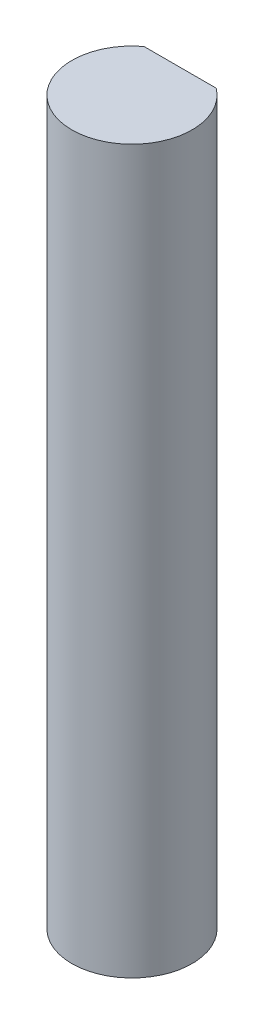
ISO-10303-21;
HEADER;
FILE_DESCRIPTION(('STEP AP214'),'2;1');
FILE_NAME('part.step','',(''),(''),'','','');
FILE_SCHEMA(('AUTOMOTIVE_DESIGN { 1 0 10303 214 1 1 1 1 }'));
ENDSEC;
DATA;
#1=APPLICATION_CONTEXT('core data for automotive mechanical design processes');
#2=APPLICATION_PROTOCOL_DEFINITION('international standard','automotive_design',2000,#1);
#3=PRODUCT_CONTEXT('',#1,'mechanical');
#4=PRODUCT('Part','Part','',(#3));
#5=PRODUCT_RELATED_PRODUCT_CATEGORY('part','',(#4));
#6=PRODUCT_DEFINITION_FORMATION('','',#4);
#7=PRODUCT_DEFINITION_CONTEXT('part definition',#1,'design');
#8=PRODUCT_DEFINITION('design','',#6,#7);
#9=PRODUCT_DEFINITION_SHAPE('','',#8);
#10=(LENGTH_UNIT() NAMED_UNIT(*) SI_UNIT(.MILLI.,.METRE.));
#11=(NAMED_UNIT(*) PLANE_ANGLE_UNIT() SI_UNIT($,.RADIAN.));
#12=(NAMED_UNIT(*) SI_UNIT($,.STERADIAN.) SOLID_ANGLE_UNIT());
#13=UNCERTAINTY_MEASURE_WITH_UNIT(LENGTH_MEASURE(1.E-05),#10,'distance_accuracy_value','');
#14=(GEOMETRIC_REPRESENTATION_CONTEXT(3) GLOBAL_UNCERTAINTY_ASSIGNED_CONTEXT((#13)) GLOBAL_UNIT_ASSIGNED_CONTEXT((#10,
#11,#12)) REPRESENTATION_CONTEXT('',''));
#15=CARTESIAN_POINT('',(0.,0.,0.));
#16=DIRECTION('',(0.,0.,1.));
#17=DIRECTION('',(1.,0.,0.));
#18=AXIS2_PLACEMENT_3D('',#15,#16,#17);
#19=CARTESIAN_POINT('',(0.,38.1,0.));
#20=DIRECTION('',(0.,-1.,0.));
#21=DIRECTION('',(0.,0.,-1.));
#22=AXIS2_PLACEMENT_3D('',#19,#20,#21);
#23=CYLINDRICAL_SURFACE('',#22,3.175);
#24=CARTESIAN_POINT('',(0.,0.,0.));
#25=DIRECTION('',(0.,1.,0.));
#26=DIRECTION('',(0.,0.,1.));
#27=AXIS2_PLACEMENT_3D('',#24,#25,#26);
#28=CIRCLE('',#27,3.175);
#29=CARTESIAN_POINT('',(-1.905,0.,-2.54));
#30=VERTEX_POINT('',#29);
#31=CARTESIAN_POINT('',(1.905,0.,-2.54));
#32=VERTEX_POINT('',#31);
#33=EDGE_CURVE('E64',#30,#32,#28,.T.);
#34=ORIENTED_EDGE('',*,*,#33,.T.);
#35=DIRECTION('',(0.,-1.,0.));
#36=VECTOR('',#35,1.);
#37=CARTESIAN_POINT('',(1.905,38.1,-2.54));
#38=LINE('',#37,#36);
#39=CARTESIAN_POINT('',(1.905,38.1,-2.54));
#40=VERTEX_POINT('',#39);
#41=EDGE_CURVE('E11',#40,#32,#38,.T.);
#42=ORIENTED_EDGE('',*,*,#41,.F.);
#43=CARTESIAN_POINT('',(0.,38.1,0.));
#44=DIRECTION('',(0.,1.,0.));
#45=DIRECTION('',(0.,0.,1.));
#46=AXIS2_PLACEMENT_3D('',#43,#44,#45);
#47=CIRCLE('',#46,3.175);
#48=CARTESIAN_POINT('',(-1.905,38.1,-2.54));
#49=VERTEX_POINT('',#48);
#50=EDGE_CURVE('E63',#49,#40,#47,.T.);
#51=ORIENTED_EDGE('',*,*,#50,.F.);
#52=DIRECTION('',(0.,-1.,0.));
#53=VECTOR('',#52,1.);
#54=CARTESIAN_POINT('',(-1.905,38.1,-2.54));
#55=LINE('',#54,#53);
#56=EDGE_CURVE('E41',#49,#30,#55,.T.);
#57=ORIENTED_EDGE('',*,*,#56,.T.);
#58=EDGE_LOOP('',(#34,#42,#51,#57));
#59=FACE_BOUND('',#58,.T.);
#60=ADVANCED_FACE('F33',(#59),#23,.T.);
#61=CARTESIAN_POINT('',(-1.905,38.1,-2.54));
#62=DIRECTION('',(0.,0.,1.));
#63=DIRECTION('',(1.,0.,0.));
#64=AXIS2_PLACEMENT_3D('',#61,#62,#63);
#65=PLANE('',#64);
#66=DIRECTION('',(-1.,0.,0.));
#67=VECTOR('',#66,1.);
#68=CARTESIAN_POINT('',(-1.905,0.,-2.54));
#69=LINE('',#68,#67);
#70=EDGE_CURVE('E56',#32,#30,#69,.T.);
#71=ORIENTED_EDGE('',*,*,#70,.T.);
#72=ORIENTED_EDGE('',*,*,#56,.F.);
#73=DIRECTION('',(-1.,0.,0.));
#74=VECTOR('',#73,1.);
#75=CARTESIAN_POINT('',(-1.905,38.1,-2.54));
#76=LINE('',#75,#74);
#77=EDGE_CURVE('E48',#40,#49,#76,.T.);
#78=ORIENTED_EDGE('',*,*,#77,.F.);
#79=ORIENTED_EDGE('',*,*,#41,.T.);
#80=EDGE_LOOP('',(#71,#72,#78,#79));
#81=FACE_BOUND('',#80,.T.);
#82=ADVANCED_FACE('F59',(#81),#65,.F.);
#83=CARTESIAN_POINT('',(0.,38.1,0.));
#84=DIRECTION('',(0.,1.,0.));
#85=DIRECTION('',(0.,0.,1.));
#86=AXIS2_PLACEMENT_3D('',#83,#84,#85);
#87=PLANE('',#86);
#88=ORIENTED_EDGE('',*,*,#50,.T.);
#89=ORIENTED_EDGE('',*,*,#77,.T.);
#90=EDGE_LOOP('',(#88,#89));
#91=FACE_BOUND('',#90,.T.);
#92=ADVANCED_FACE('F71',(#91),#87,.T.);
#93=CARTESIAN_POINT('',(0.,0.,0.));
#94=DIRECTION('',(0.,1.,0.));
#95=DIRECTION('',(0.,0.,1.));
#96=AXIS2_PLACEMENT_3D('',#93,#94,#95);
#97=PLANE('',#96);
#98=ORIENTED_EDGE('',*,*,#33,.F.);
#99=ORIENTED_EDGE('',*,*,#70,.F.);
#100=EDGE_LOOP('',(#98,#99));
#101=FACE_BOUND('',#100,.T.);
#102=ADVANCED_FACE('F67',(#101),#97,.F.);
#103=CLOSED_SHELL('',(#60,#82,#92,#102));
#104=MANIFOLD_SOLID_BREP('B2',#103);
#105=ADVANCED_BREP_SHAPE_REPRESENTATION('',(#18,#104),#14);
#106=SHAPE_DEFINITION_REPRESENTATION(#9,#105);
ENDSEC;
END-ISO-10303-21;
